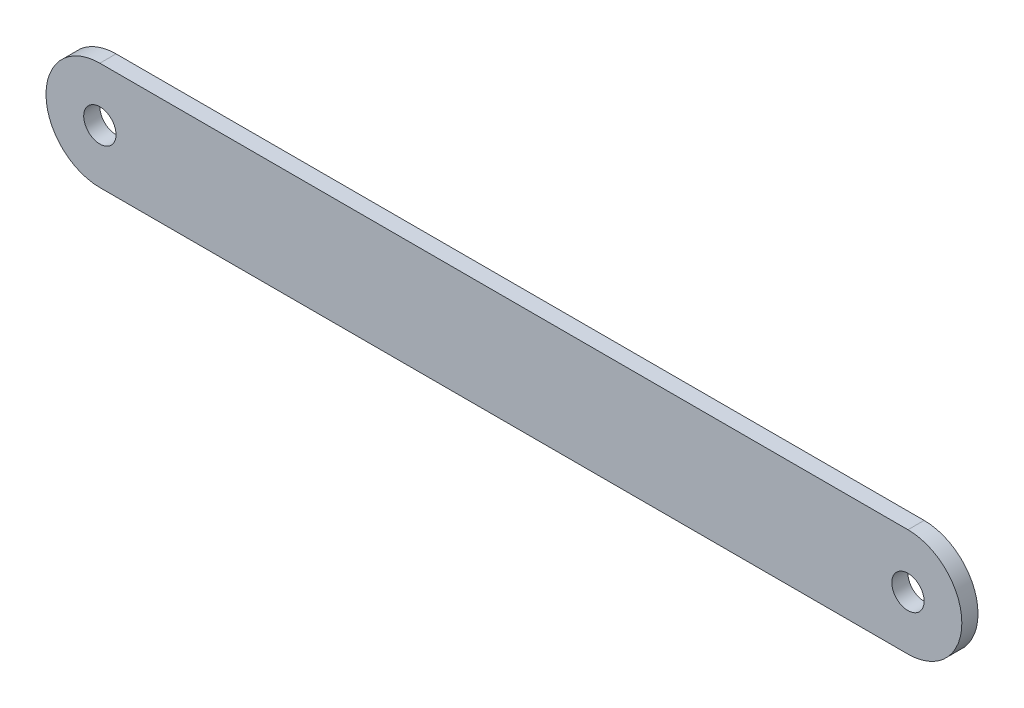
ISO-10303-21;
HEADER;
FILE_DESCRIPTION(('STEP AP214'),'2;1');
FILE_NAME('part.step','',(''),(''),'','','');
FILE_SCHEMA(('AUTOMOTIVE_DESIGN { 1 0 10303 214 1 1 1 1 }'));
ENDSEC;
DATA;
#1=APPLICATION_CONTEXT('core data for automotive mechanical design processes');
#2=APPLICATION_PROTOCOL_DEFINITION('international standard','automotive_design',2000,#1);
#3=PRODUCT_CONTEXT('',#1,'mechanical');
#4=PRODUCT('Part','Part','',(#3));
#5=PRODUCT_RELATED_PRODUCT_CATEGORY('part','',(#4));
#6=PRODUCT_DEFINITION_FORMATION('','',#4);
#7=PRODUCT_DEFINITION_CONTEXT('part definition',#1,'design');
#8=PRODUCT_DEFINITION('design','',#6,#7);
#9=PRODUCT_DEFINITION_SHAPE('','',#8);
#10=(LENGTH_UNIT() NAMED_UNIT(*) SI_UNIT(.MILLI.,.METRE.));
#11=(NAMED_UNIT(*) PLANE_ANGLE_UNIT() SI_UNIT($,.RADIAN.));
#12=(NAMED_UNIT(*) SI_UNIT($,.STERADIAN.) SOLID_ANGLE_UNIT());
#13=UNCERTAINTY_MEASURE_WITH_UNIT(LENGTH_MEASURE(1.E-05),#10,'distance_accuracy_value','');
#14=(GEOMETRIC_REPRESENTATION_CONTEXT(3) GLOBAL_UNCERTAINTY_ASSIGNED_CONTEXT((#13)) GLOBAL_UNIT_ASSIGNED_CONTEXT((#10,
#11,#12)) REPRESENTATION_CONTEXT('',''));
#15=CARTESIAN_POINT('',(0.,0.,0.));
#16=DIRECTION('',(0.,0.,1.));
#17=DIRECTION('',(1.,0.,0.));
#18=AXIS2_PLACEMENT_3D('',#15,#16,#17);
#19=CARTESIAN_POINT('',(0.,9.99999999999997,3.));
#20=DIRECTION('',(0.,-1.,0.));
#21=DIRECTION('',(1.,0.,0.));
#22=AXIS2_PLACEMENT_3D('',#19,#20,#21);
#23=PLANE('',#22);
#24=DIRECTION('',(-1.,0.,0.));
#25=VECTOR('',#24,1.);
#26=CARTESIAN_POINT('',(0.,9.99999999999997,0.));
#27=LINE('',#26,#25);
#28=CARTESIAN_POINT('',(75.,9.99999999999998,0.));
#29=VERTEX_POINT('',#28);
#30=CARTESIAN_POINT('',(-75.,9.99999999999996,0.));
#31=VERTEX_POINT('',#30);
#32=EDGE_CURVE('E117',#29,#31,#27,.T.);
#33=ORIENTED_EDGE('',*,*,#32,.T.);
#34=DIRECTION('',(0.,0.,-1.));
#35=VECTOR('',#34,1.);
#36=CARTESIAN_POINT('',(-75.,9.99999999999996,3.));
#37=LINE('',#36,#35);
#38=CARTESIAN_POINT('',(-75.,9.99999999999996,3.));
#39=VERTEX_POINT('',#38);
#40=EDGE_CURVE('E11',#39,#31,#37,.T.);
#41=ORIENTED_EDGE('',*,*,#40,.F.);
#42=DIRECTION('',(-1.,0.,0.));
#43=VECTOR('',#42,1.);
#44=CARTESIAN_POINT('',(0.,9.99999999999997,3.));
#45=LINE('',#44,#43);
#46=CARTESIAN_POINT('',(75.,9.99999999999998,3.));
#47=VERTEX_POINT('',#46);
#48=EDGE_CURVE('E90',#47,#39,#45,.T.);
#49=ORIENTED_EDGE('',*,*,#48,.F.);
#50=DIRECTION('',(0.,0.,-1.));
#51=VECTOR('',#50,1.);
#52=CARTESIAN_POINT('',(75.,9.99999999999998,3.));
#53=LINE('',#52,#51);
#54=EDGE_CURVE('E116',#47,#29,#53,.T.);
#55=ORIENTED_EDGE('',*,*,#54,.T.);
#56=EDGE_LOOP('',(#33,#41,#49,#55));
#57=FACE_BOUND('',#56,.T.);
#58=ADVANCED_FACE('F41',(#57),#23,.F.);
#59=CARTESIAN_POINT('',(-75.,0.,3.));
#60=DIRECTION('',(0.,0.,-1.));
#61=DIRECTION('',(-1.,0.,0.));
#62=AXIS2_PLACEMENT_3D('',#59,#60,#61);
#63=CYLINDRICAL_SURFACE('',#62,10.);
#64=CARTESIAN_POINT('',(-75.,0.,0.));
#65=DIRECTION('',(0.,0.,1.));
#66=DIRECTION('',(1.,0.,0.));
#67=AXIS2_PLACEMENT_3D('',#64,#65,#66);
#68=CIRCLE('',#67,10.);
#69=CARTESIAN_POINT('',(-75.,-10.,0.));
#70=VERTEX_POINT('',#69);
#71=EDGE_CURVE('E96',#31,#70,#68,.T.);
#72=ORIENTED_EDGE('',*,*,#71,.T.);
#73=DIRECTION('',(0.,0.,-1.));
#74=VECTOR('',#73,1.);
#75=CARTESIAN_POINT('',(-75.,-10.,3.));
#76=LINE('',#75,#74);
#77=CARTESIAN_POINT('',(-75.,-10.,3.));
#78=VERTEX_POINT('',#77);
#79=EDGE_CURVE('E50',#78,#70,#76,.T.);
#80=ORIENTED_EDGE('',*,*,#79,.F.);
#81=CARTESIAN_POINT('',(-75.,0.,3.));
#82=DIRECTION('',(0.,0.,1.));
#83=DIRECTION('',(1.,0.,0.));
#84=AXIS2_PLACEMENT_3D('',#81,#82,#83);
#85=CIRCLE('',#84,10.);
#86=EDGE_CURVE('E84',#39,#78,#85,.T.);
#87=ORIENTED_EDGE('',*,*,#86,.F.);
#88=ORIENTED_EDGE('',*,*,#40,.T.);
#89=EDGE_LOOP('',(#72,#80,#87,#88));
#90=FACE_BOUND('',#89,.T.);
#91=ADVANCED_FACE('F95',(#90),#63,.T.);
#92=CARTESIAN_POINT('',(0.,-10.,3.));
#93=DIRECTION('',(0.,-1.,0.));
#94=DIRECTION('',(1.,0.,0.));
#95=AXIS2_PLACEMENT_3D('',#92,#93,#94);
#96=PLANE('',#95);
#97=DIRECTION('',(-1.,0.,0.));
#98=VECTOR('',#97,1.);
#99=CARTESIAN_POINT('',(0.,-10.,0.));
#100=LINE('',#99,#98);
#101=CARTESIAN_POINT('',(75.,-10.,0.));
#102=VERTEX_POINT('',#101);
#103=EDGE_CURVE('E123',#102,#70,#100,.T.);
#104=ORIENTED_EDGE('',*,*,#103,.F.);
#105=DIRECTION('',(0.,0.,-1.));
#106=VECTOR('',#105,1.);
#107=CARTESIAN_POINT('',(75.,-10.,3.));
#108=LINE('',#107,#106);
#109=CARTESIAN_POINT('',(75.,-10.,3.));
#110=VERTEX_POINT('',#109);
#111=EDGE_CURVE('E74',#110,#102,#108,.T.);
#112=ORIENTED_EDGE('',*,*,#111,.F.);
#113=DIRECTION('',(-1.,0.,0.));
#114=VECTOR('',#113,1.);
#115=CARTESIAN_POINT('',(0.,-10.,3.));
#116=LINE('',#115,#114);
#117=EDGE_CURVE('E88',#110,#78,#116,.T.);
#118=ORIENTED_EDGE('',*,*,#117,.T.);
#119=ORIENTED_EDGE('',*,*,#79,.T.);
#120=EDGE_LOOP('',(#104,#112,#118,#119));
#121=FACE_BOUND('',#120,.T.);
#122=ADVANCED_FACE('F101',(#121),#96,.T.);
#123=CARTESIAN_POINT('',(75.,0.,3.));
#124=DIRECTION('',(0.,0.,-1.));
#125=DIRECTION('',(-1.,0.,0.));
#126=AXIS2_PLACEMENT_3D('',#123,#124,#125);
#127=CYLINDRICAL_SURFACE('',#126,3.00000000000001);
#128=CARTESIAN_POINT('',(75.,0.,3.));
#129=DIRECTION('',(0.,0.,1.));
#130=DIRECTION('',(1.,0.,0.));
#131=AXIS2_PLACEMENT_3D('',#128,#129,#130);
#132=CIRCLE('',#131,3.00000000000001);
#133=CARTESIAN_POINT('',(78.,0.,3.));
#134=VERTEX_POINT('',#133);
#135=EDGE_CURVE('E105',#134,#134,#132,.T.);
#136=ORIENTED_EDGE('',*,*,#135,.T.);
#137=EDGE_LOOP('',(#136));
#138=FACE_BOUND('',#137,.T.);
#139=CARTESIAN_POINT('',(75.,0.,0.));
#140=DIRECTION('',(0.,0.,1.));
#141=DIRECTION('',(1.,0.,0.));
#142=AXIS2_PLACEMENT_3D('',#139,#140,#141);
#143=CIRCLE('',#142,3.00000000000001);
#144=CARTESIAN_POINT('',(78.,0.,0.));
#145=VERTEX_POINT('',#144);
#146=EDGE_CURVE('E128',#145,#145,#143,.T.);
#147=ORIENTED_EDGE('',*,*,#146,.F.);
#148=EDGE_LOOP('',(#147));
#149=FACE_BOUND('',#148,.T.);
#150=ADVANCED_FACE('F160',(#138,#149),#127,.F.);
#151=CARTESIAN_POINT('',(75.,0.,3.));
#152=DIRECTION('',(0.,0.,-1.));
#153=DIRECTION('',(-1.,0.,0.));
#154=AXIS2_PLACEMENT_3D('',#151,#152,#153);
#155=CYLINDRICAL_SURFACE('',#154,10.);
#156=CARTESIAN_POINT('',(75.,0.,0.));
#157=DIRECTION('',(0.,0.,1.));
#158=DIRECTION('',(1.,0.,0.));
#159=AXIS2_PLACEMENT_3D('',#156,#157,#158);
#160=CIRCLE('',#159,10.);
#161=EDGE_CURVE('E77',#102,#29,#160,.T.);
#162=ORIENTED_EDGE('',*,*,#161,.T.);
#163=ORIENTED_EDGE('',*,*,#54,.F.);
#164=CARTESIAN_POINT('',(75.,0.,3.));
#165=DIRECTION('',(0.,0.,1.));
#166=DIRECTION('',(1.,0.,0.));
#167=AXIS2_PLACEMENT_3D('',#164,#165,#166);
#168=CIRCLE('',#167,10.);
#169=EDGE_CURVE('E58',#110,#47,#168,.T.);
#170=ORIENTED_EDGE('',*,*,#169,.F.);
#171=ORIENTED_EDGE('',*,*,#111,.T.);
#172=EDGE_LOOP('',(#162,#163,#170,#171));
#173=FACE_BOUND('',#172,.T.);
#174=ADVANCED_FACE('F152',(#173),#155,.T.);
#175=CARTESIAN_POINT('',(-75.,0.,3.));
#176=DIRECTION('',(0.,0.,-1.));
#177=DIRECTION('',(-1.,0.,0.));
#178=AXIS2_PLACEMENT_3D('',#175,#176,#177);
#179=CYLINDRICAL_SURFACE('',#178,3.00000000000001);
#180=CARTESIAN_POINT('',(-75.,0.,3.));
#181=DIRECTION('',(0.,0.,1.));
#182=DIRECTION('',(1.,0.,0.));
#183=AXIS2_PLACEMENT_3D('',#180,#181,#182);
#184=CIRCLE('',#183,3.00000000000001);
#185=CARTESIAN_POINT('',(-72.,0.,3.));
#186=VERTEX_POINT('',#185);
#187=EDGE_CURVE('E112',#186,#186,#184,.F.);
#188=ORIENTED_EDGE('',*,*,#187,.F.);
#189=EDGE_LOOP('',(#188));
#190=FACE_BOUND('',#189,.T.);
#191=CARTESIAN_POINT('',(-75.,0.,0.));
#192=DIRECTION('',(0.,0.,1.));
#193=DIRECTION('',(1.,0.,0.));
#194=AXIS2_PLACEMENT_3D('',#191,#192,#193);
#195=CIRCLE('',#194,3.00000000000001);
#196=CARTESIAN_POINT('',(-72.,0.,0.));
#197=VERTEX_POINT('',#196);
#198=EDGE_CURVE('E132',#197,#197,#195,.F.);
#199=ORIENTED_EDGE('',*,*,#198,.T.);
#200=EDGE_LOOP('',(#199));
#201=FACE_BOUND('',#200,.T.);
#202=ADVANCED_FACE('F150',(#190,#201),#179,.F.);
#203=CARTESIAN_POINT('',(0.,0.,3.));
#204=DIRECTION('',(0.,0.,1.));
#205=DIRECTION('',(1.,0.,0.));
#206=AXIS2_PLACEMENT_3D('',#203,#204,#205);
#207=PLANE('',#206);
#208=ORIENTED_EDGE('',*,*,#48,.T.);
#209=ORIENTED_EDGE('',*,*,#86,.T.);
#210=ORIENTED_EDGE('',*,*,#117,.F.);
#211=ORIENTED_EDGE('',*,*,#169,.T.);
#212=EDGE_LOOP('',(#208,#209,#210,#211));
#213=FACE_BOUND('',#212,.T.);
#214=ORIENTED_EDGE('',*,*,#135,.F.);
#215=EDGE_LOOP('',(#214));
#216=FACE_BOUND('',#215,.T.);
#217=ORIENTED_EDGE('',*,*,#187,.T.);
#218=EDGE_LOOP('',(#217));
#219=FACE_BOUND('',#218,.T.);
#220=ADVANCED_FACE('F85',(#213,#216,#219),#207,.T.);
#221=CARTESIAN_POINT('',(0.,0.,0.));
#222=DIRECTION('',(0.,0.,1.));
#223=DIRECTION('',(1.,0.,0.));
#224=AXIS2_PLACEMENT_3D('',#221,#222,#223);
#225=PLANE('',#224);
#226=ORIENTED_EDGE('',*,*,#32,.F.);
#227=ORIENTED_EDGE('',*,*,#161,.F.);
#228=ORIENTED_EDGE('',*,*,#103,.T.);
#229=ORIENTED_EDGE('',*,*,#71,.F.);
#230=EDGE_LOOP('',(#226,#227,#228,#229));
#231=FACE_BOUND('',#230,.T.);
#232=ORIENTED_EDGE('',*,*,#146,.T.);
#233=EDGE_LOOP('',(#232));
#234=FACE_BOUND('',#233,.T.);
#235=ORIENTED_EDGE('',*,*,#198,.F.);
#236=EDGE_LOOP('',(#235));
#237=FACE_BOUND('',#236,.T.);
#238=ADVANCED_FACE('F142',(#231,#234,#237),#225,.F.);
#239=CLOSED_SHELL('',(#58,#91,#122,#150,#174,#202,#220,#238));
#240=MANIFOLD_SOLID_BREP('B2',#239);
#241=ADVANCED_BREP_SHAPE_REPRESENTATION('',(#18,#240),#14);
#242=SHAPE_DEFINITION_REPRESENTATION(#9,#241);
ENDSEC;
END-ISO-10303-21;
